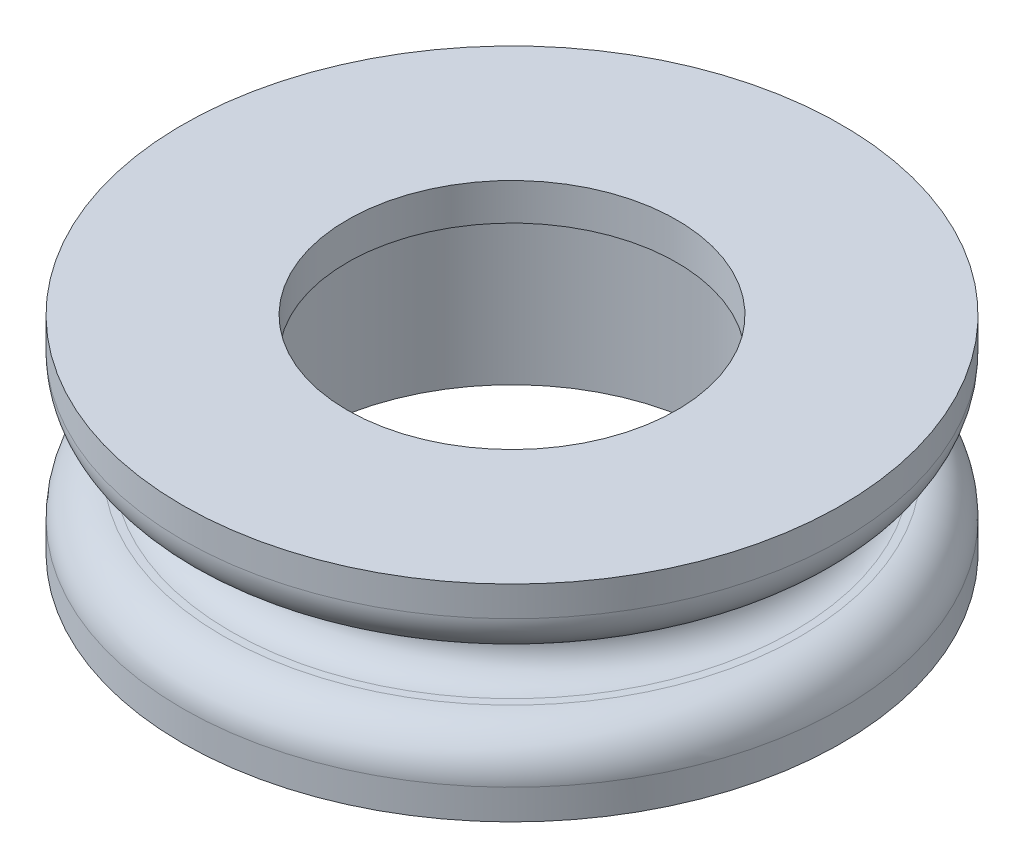
ISO-10303-21;
HEADER;
FILE_DESCRIPTION(('STEP AP214'),'2;1');
FILE_NAME('part.step','',(''),(''),'','','');
FILE_SCHEMA(('AUTOMOTIVE_DESIGN { 1 0 10303 214 1 1 1 1 }'));
ENDSEC;
DATA;
#1=APPLICATION_CONTEXT('core data for automotive mechanical design processes');
#2=APPLICATION_PROTOCOL_DEFINITION('international standard','automotive_design',2000,#1);
#3=PRODUCT_CONTEXT('',#1,'mechanical');
#4=PRODUCT('Part','Part','',(#3));
#5=PRODUCT_RELATED_PRODUCT_CATEGORY('part','',(#4));
#6=PRODUCT_DEFINITION_FORMATION('','',#4);
#7=PRODUCT_DEFINITION_CONTEXT('part definition',#1,'design');
#8=PRODUCT_DEFINITION('design','',#6,#7);
#9=PRODUCT_DEFINITION_SHAPE('','',#8);
#10=(LENGTH_UNIT() NAMED_UNIT(*) SI_UNIT(.MILLI.,.METRE.));
#11=(NAMED_UNIT(*) PLANE_ANGLE_UNIT() SI_UNIT($,.RADIAN.));
#12=(NAMED_UNIT(*) SI_UNIT($,.STERADIAN.) SOLID_ANGLE_UNIT());
#13=UNCERTAINTY_MEASURE_WITH_UNIT(LENGTH_MEASURE(1.E-05),#10,'distance_accuracy_value','');
#14=(GEOMETRIC_REPRESENTATION_CONTEXT(3) GLOBAL_UNCERTAINTY_ASSIGNED_CONTEXT((#13)) GLOBAL_UNIT_ASSIGNED_CONTEXT((#10,
#11,#12)) REPRESENTATION_CONTEXT('',''));
#15=CARTESIAN_POINT('',(0.,0.,0.));
#16=DIRECTION('',(0.,0.,1.));
#17=DIRECTION('',(1.,0.,0.));
#18=AXIS2_PLACEMENT_3D('',#15,#16,#17);
#19=CARTESIAN_POINT('',(0.,5.55752,-17.78));
#20=DIRECTION('',(0.,-1.,0.));
#21=DIRECTION('',(0.,0.,-1.));
#22=AXIS2_PLACEMENT_3D('',#19,#20,#21);
#23=PLANE('',#22);
#24=CARTESIAN_POINT('',(0.,5.55752,0.));
#25=DIRECTION('',(0.,1.,0.));
#26=DIRECTION('',(0.,0.,1.));
#27=AXIS2_PLACEMENT_3D('',#24,#25,#26);
#28=CIRCLE('',#27,8.89);
#29=CARTESIAN_POINT('',(0.,5.55752,8.89));
#30=VERTEX_POINT('',#29);
#31=EDGE_CURVE('E65',#30,#30,#28,.T.);
#32=ORIENTED_EDGE('',*,*,#31,.F.);
#33=EDGE_LOOP('',(#32));
#34=FACE_BOUND('',#33,.T.);
#35=CARTESIAN_POINT('',(0.,5.55752,0.));
#36=DIRECTION('',(0.,1.,0.));
#37=DIRECTION('',(0.,0.,1.));
#38=AXIS2_PLACEMENT_3D('',#35,#36,#37);
#39=CIRCLE('',#38,17.78);
#40=CARTESIAN_POINT('',(0.,5.55752,17.78));
#41=VERTEX_POINT('',#40);
#42=EDGE_CURVE('E80',#41,#41,#39,.T.);
#43=ORIENTED_EDGE('',*,*,#42,.T.);
#44=EDGE_LOOP('',(#43));
#45=FACE_BOUND('',#44,.T.);
#46=ADVANCED_FACE('F33',(#34,#45),#23,.F.);
#47=CARTESIAN_POINT('',(0.,16.043148,0.));
#48=DIRECTION('',(0.,1.,0.));
#49=DIRECTION('',(0.,0.,1.));
#50=AXIS2_PLACEMENT_3D('',#47,#48,#49);
#51=CYLINDRICAL_SURFACE('',#50,8.89);
#52=CARTESIAN_POINT('',(0.,3.5687,0.));
#53=DIRECTION('',(0.,1.,0.));
#54=DIRECTION('',(0.,0.,1.));
#55=AXIS2_PLACEMENT_3D('',#52,#53,#54);
#56=CIRCLE('',#55,8.89);
#57=CARTESIAN_POINT('',(0.,3.5687,8.89));
#58=VERTEX_POINT('',#57);
#59=EDGE_CURVE('E68',#58,#58,#56,.T.);
#60=ORIENTED_EDGE('',*,*,#59,.F.);
#61=EDGE_LOOP('',(#60));
#62=FACE_BOUND('',#61,.T.);
#63=ORIENTED_EDGE('',*,*,#31,.T.);
#64=EDGE_LOOP('',(#63));
#65=FACE_BOUND('',#64,.T.);
#66=ADVANCED_FACE('F101',(#62,#65),#51,.F.);
#67=CARTESIAN_POINT('',(0.,3.5687,-8.89));
#68=DIRECTION('',(0.,1.,0.));
#69=DIRECTION('',(0.,0.,1.));
#70=AXIS2_PLACEMENT_3D('',#67,#68,#69);
#71=PLANE('',#70);
#72=CARTESIAN_POINT('',(0.,3.5687,0.));
#73=DIRECTION('',(0.,1.,0.));
#74=DIRECTION('',(0.,0.,1.));
#75=AXIS2_PLACEMENT_3D('',#72,#73,#74);
#76=CIRCLE('',#75,11.1125);
#77=CARTESIAN_POINT('',(0.,3.5687,11.1125));
#78=VERTEX_POINT('',#77);
#79=EDGE_CURVE('E71',#78,#78,#76,.T.);
#80=ORIENTED_EDGE('',*,*,#79,.F.);
#81=EDGE_LOOP('',(#80));
#82=FACE_BOUND('',#81,.T.);
#83=ORIENTED_EDGE('',*,*,#59,.T.);
#84=EDGE_LOOP('',(#83));
#85=FACE_BOUND('',#84,.T.);
#86=ADVANCED_FACE('F107',(#82,#85),#71,.F.);
#87=CARTESIAN_POINT('',(0.,16.043148,0.));
#88=DIRECTION('',(0.,1.,0.));
#89=DIRECTION('',(0.,0.,1.));
#90=AXIS2_PLACEMENT_3D('',#87,#88,#89);
#91=CYLINDRICAL_SURFACE('',#90,11.1125);
#92=CARTESIAN_POINT('',(0.,-5.55752,0.));
#93=DIRECTION('',(0.,1.,0.));
#94=DIRECTION('',(0.,0.,1.));
#95=AXIS2_PLACEMENT_3D('',#92,#93,#94);
#96=CIRCLE('',#95,11.1125);
#97=CARTESIAN_POINT('',(0.,-5.55752,11.1125));
#98=VERTEX_POINT('',#97);
#99=EDGE_CURVE('E74',#98,#98,#96,.T.);
#100=ORIENTED_EDGE('',*,*,#99,.F.);
#101=EDGE_LOOP('',(#100));
#102=FACE_BOUND('',#101,.T.);
#103=ORIENTED_EDGE('',*,*,#79,.T.);
#104=EDGE_LOOP('',(#103));
#105=FACE_BOUND('',#104,.T.);
#106=ADVANCED_FACE('F143',(#102,#105),#91,.F.);
#107=CARTESIAN_POINT('',(0.,-5.55752,-11.1125));
#108=DIRECTION('',(0.,1.,0.));
#109=DIRECTION('',(0.,0.,1.));
#110=AXIS2_PLACEMENT_3D('',#107,#108,#109);
#111=PLANE('',#110);
#112=CARTESIAN_POINT('',(0.,-5.55752,0.));
#113=DIRECTION('',(0.,1.,0.));
#114=DIRECTION('',(0.,0.,1.));
#115=AXIS2_PLACEMENT_3D('',#112,#113,#114);
#116=CIRCLE('',#115,17.78);
#117=CARTESIAN_POINT('',(0.,-5.55752,17.78));
#118=VERTEX_POINT('',#117);
#119=EDGE_CURVE('E77',#118,#118,#116,.T.);
#120=ORIENTED_EDGE('',*,*,#119,.F.);
#121=EDGE_LOOP('',(#120));
#122=FACE_BOUND('',#121,.T.);
#123=ORIENTED_EDGE('',*,*,#99,.T.);
#124=EDGE_LOOP('',(#123));
#125=FACE_BOUND('',#124,.T.);
#126=ADVANCED_FACE('F139',(#122,#125),#111,.F.);
#127=CARTESIAN_POINT('',(0.,16.043148,0.));
#128=DIRECTION('',(0.,1.,0.));
#129=DIRECTION('',(0.,0.,1.));
#130=AXIS2_PLACEMENT_3D('',#127,#128,#129);
#131=CYLINDRICAL_SURFACE('',#130,17.78);
#132=CARTESIAN_POINT('',(0.,-3.9379064612863,0.));
#133=DIRECTION('',(0.,-1.,0.));
#134=DIRECTION('',(0.,0.,-1.));
#135=AXIS2_PLACEMENT_3D('',#132,#133,#134);
#136=CIRCLE('',#135,17.78);
#137=CARTESIAN_POINT('',(0.,-3.9379064612863,-17.78));
#138=VERTEX_POINT('',#137);
#139=EDGE_CURVE('E59',#138,#138,#136,.T.);
#140=ORIENTED_EDGE('',*,*,#139,.T.);
#141=EDGE_LOOP('',(#140));
#142=FACE_BOUND('',#141,.T.);
#143=ORIENTED_EDGE('',*,*,#119,.T.);
#144=EDGE_LOOP('',(#143));
#145=FACE_BOUND('',#144,.T.);
#146=ADVANCED_FACE('F134',(#142,#145),#131,.T.);
#147=CARTESIAN_POINT('',(0.,-1.7399,0.));
#148=DIRECTION('',(0.,-1.,0.));
#149=DIRECTION('',(0.,0.,-1.));
#150=AXIS2_PLACEMENT_3D('',#147,#148,#149);
#151=CONICAL_SURFACE('',#150,17.78,1.53155363311907);
#152=CARTESIAN_POINT('',(0.,-1.63770349001124,0.));
#153=DIRECTION('',(0.,-1.,0.));
#154=DIRECTION('',(0.,0.,-1.));
#155=AXIS2_PLACEMENT_3D('',#152,#153,#154);
#156=CIRCLE('',#155,15.1771194499221);
#157=CARTESIAN_POINT('',(0.,-1.63770349001124,-15.1771194499221));
#158=VERTEX_POINT('',#157);
#159=EDGE_CURVE('E40',#158,#158,#156,.T.);
#160=ORIENTED_EDGE('',*,*,#159,.T.);
#161=EDGE_LOOP('',(#160));
#162=FACE_BOUND('',#161,.T.);
#163=CARTESIAN_POINT('',(0.,-1.65366644284114,0.));
#164=DIRECTION('',(0.,1.,0.));
#165=DIRECTION('',(0.,0.,1.));
#166=AXIS2_PLACEMENT_3D('',#163,#164,#165);
#167=CIRCLE('',#166,15.583685774422);
#168=CARTESIAN_POINT('',(0.,-1.65366644284115,15.583685774422));
#169=VERTEX_POINT('',#168);
#170=EDGE_CURVE('E62',#169,#169,#167,.T.);
#171=ORIENTED_EDGE('',*,*,#170,.T.);
#172=EDGE_LOOP('',(#171));
#173=FACE_BOUND('',#172,.T.);
#174=ADVANCED_FACE('F127',(#162,#173),#151,.T.);
#175=CARTESIAN_POINT('',(0.,16.043148,0.));
#176=DIRECTION('',(0.,1.,0.));
#177=DIRECTION('',(0.,0.,1.));
#178=AXIS2_PLACEMENT_3D('',#175,#176,#177);
#179=CYLINDRICAL_SURFACE('',#178,13.6396994920175);
#180=CARTESIAN_POINT('',(0.,-0.0387354770995975,0.));
#181=DIRECTION('',(0.,1.,0.));
#182=DIRECTION('',(0.,0.,1.));
#183=AXIS2_PLACEMENT_3D('',#180,#181,#182);
#184=CIRCLE('',#183,13.6396994920175);
#185=CARTESIAN_POINT('',(0.,-0.0387354770995991,13.6396994920175));
#186=VERTEX_POINT('',#185);
#187=EDGE_CURVE('E44',#186,#186,#184,.T.);
#188=ORIENTED_EDGE('',*,*,#187,.T.);
#189=EDGE_LOOP('',(#188));
#190=FACE_BOUND('',#189,.T.);
#191=CARTESIAN_POINT('',(0.,0.0387354770995905,0.));
#192=DIRECTION('',(0.,1.,0.));
#193=DIRECTION('',(0.,0.,1.));
#194=AXIS2_PLACEMENT_3D('',#191,#192,#193);
#195=CIRCLE('',#194,13.6396994920175);
#196=CARTESIAN_POINT('',(0.,0.0387354770995889,13.6396994920175));
#197=VERTEX_POINT('',#196);
#198=EDGE_CURVE('E48',#197,#197,#195,.F.);
#199=ORIENTED_EDGE('',*,*,#198,.T.);
#200=EDGE_LOOP('',(#199));
#201=FACE_BOUND('',#200,.T.);
#202=ADVANCED_FACE('F98',(#190,#201),#179,.T.);
#203=CARTESIAN_POINT('',(0.,1.57734,0.));
#204=DIRECTION('',(0.,1.,0.));
#205=DIRECTION('',(0.,0.,1.));
#206=AXIS2_PLACEMENT_3D('',#203,#204,#205);
#207=CONICAL_SURFACE('',#206,13.6396994920175,1.53155363311908);
#208=CARTESIAN_POINT('',(0.,1.63770349001119,0.));
#209=DIRECTION('',(0.,1.,0.));
#210=DIRECTION('',(0.,0.,1.));
#211=AXIS2_PLACEMENT_3D('',#208,#209,#210);
#212=CIRCLE('',#211,15.1771194499221);
#213=CARTESIAN_POINT('',(0.,1.63770349001119,15.1771194499221));
#214=VERTEX_POINT('',#213);
#215=EDGE_CURVE('E10',#214,#214,#212,.T.);
#216=ORIENTED_EDGE('',*,*,#215,.T.);
#217=EDGE_LOOP('',(#216));
#218=FACE_BOUND('',#217,.T.);
#219=CARTESIAN_POINT('',(0.,1.65366644284114,0.));
#220=DIRECTION('',(0.,-1.,0.));
#221=DIRECTION('',(0.,0.,-1.));
#222=AXIS2_PLACEMENT_3D('',#219,#220,#221);
#223=CIRCLE('',#222,15.583685774422);
#224=CARTESIAN_POINT('',(0.,1.65366644284114,-15.583685774422));
#225=VERTEX_POINT('',#224);
#226=EDGE_CURVE('E53',#225,#225,#223,.T.);
#227=ORIENTED_EDGE('',*,*,#226,.T.);
#228=EDGE_LOOP('',(#227));
#229=FACE_BOUND('',#228,.T.);
#230=ADVANCED_FACE('F88',(#218,#229),#207,.T.);
#231=CARTESIAN_POINT('',(0.,16.043148,0.));
#232=DIRECTION('',(0.,1.,0.));
#233=DIRECTION('',(0.,0.,1.));
#234=AXIS2_PLACEMENT_3D('',#231,#232,#233);
#235=CYLINDRICAL_SURFACE('',#234,17.78);
#236=CARTESIAN_POINT('',(0.,3.9379064612863,0.));
#237=DIRECTION('',(0.,-1.,0.));
#238=DIRECTION('',(0.,0.,-1.));
#239=AXIS2_PLACEMENT_3D('',#236,#237,#238);
#240=CIRCLE('',#239,17.78);
#241=CARTESIAN_POINT('',(0.,3.9379064612863,-17.78));
#242=VERTEX_POINT('',#241);
#243=EDGE_CURVE('E56',#242,#242,#240,.F.);
#244=ORIENTED_EDGE('',*,*,#243,.T.);
#245=EDGE_LOOP('',(#244));
#246=FACE_BOUND('',#245,.T.);
#247=ORIENTED_EDGE('',*,*,#42,.F.);
#248=EDGE_LOOP('',(#247));
#249=FACE_BOUND('',#248,.T.);
#250=ADVANCED_FACE('F85',(#246,#249),#235,.T.);
#251=CARTESIAN_POINT('',(0.,-3.9379064612863,0.));
#252=DIRECTION('',(0.,-1.,0.));
#253=DIRECTION('',(0.,0.,-1.));
#254=AXIS2_PLACEMENT_3D('',#251,#252,#253);
#255=TOROIDAL_SURFACE('',#254,15.494,2.286);
#256=ORIENTED_EDGE('',*,*,#139,.F.);
#257=EDGE_LOOP('',(#256));
#258=FACE_BOUND('',#257,.T.);
#259=ORIENTED_EDGE('',*,*,#170,.F.);
#260=EDGE_LOOP('',(#259));
#261=FACE_BOUND('',#260,.T.);
#262=ADVANCED_FACE('F87',(#258,#261),#255,.T.);
#263=CARTESIAN_POINT('',(0.,3.9379064612863,0.));
#264=DIRECTION('',(0.,-1.,0.));
#265=DIRECTION('',(0.,0.,-1.));
#266=AXIS2_PLACEMENT_3D('',#263,#264,#265);
#267=TOROIDAL_SURFACE('',#266,15.494,2.286);
#268=ORIENTED_EDGE('',*,*,#226,.F.);
#269=EDGE_LOOP('',(#268));
#270=FACE_BOUND('',#269,.T.);
#271=ORIENTED_EDGE('',*,*,#243,.F.);
#272=EDGE_LOOP('',(#271));
#273=FACE_BOUND('',#272,.T.);
#274=ADVANCED_FACE('F95',(#270,#273),#267,.T.);
#275=CARTESIAN_POINT('',(0.,-0.038735477099594,0.));
#276=DIRECTION('',(0.,1.,0.));
#277=DIRECTION('',(0.,0.,1.));
#278=AXIS2_PLACEMENT_3D('',#275,#276,#277);
#279=TOROIDAL_SURFACE('',#278,15.2398994920175,1.6002);
#280=ORIENTED_EDGE('',*,*,#159,.F.);
#281=EDGE_LOOP('',(#280));
#282=FACE_BOUND('',#281,.T.);
#283=ORIENTED_EDGE('',*,*,#187,.F.);
#284=EDGE_LOOP('',(#283));
#285=FACE_BOUND('',#284,.T.);
#286=ADVANCED_FACE('F114',(#282,#285),#279,.F.);
#287=CARTESIAN_POINT('',(0.,0.0387354770995905,0.));
#288=DIRECTION('',(0.,1.,0.));
#289=DIRECTION('',(0.,0.,1.));
#290=AXIS2_PLACEMENT_3D('',#287,#288,#289);
#291=TOROIDAL_SURFACE('',#290,15.2398994920175,1.6002);
#292=ORIENTED_EDGE('',*,*,#198,.F.);
#293=EDGE_LOOP('',(#292));
#294=FACE_BOUND('',#293,.T.);
#295=ORIENTED_EDGE('',*,*,#215,.F.);
#296=EDGE_LOOP('',(#295));
#297=FACE_BOUND('',#296,.T.);
#298=ADVANCED_FACE('F35',(#294,#297),#291,.F.);
#299=CLOSED_SHELL('',(#46,#66,#86,#106,#126,#146,#174,#202,#230,#250,#262,#274,#286,#298));
#300=MANIFOLD_SOLID_BREP('B2',#299);
#301=ADVANCED_BREP_SHAPE_REPRESENTATION('',(#18,#300),#14);
#302=SHAPE_DEFINITION_REPRESENTATION(#9,#301);
ENDSEC;
END-ISO-10303-21;
